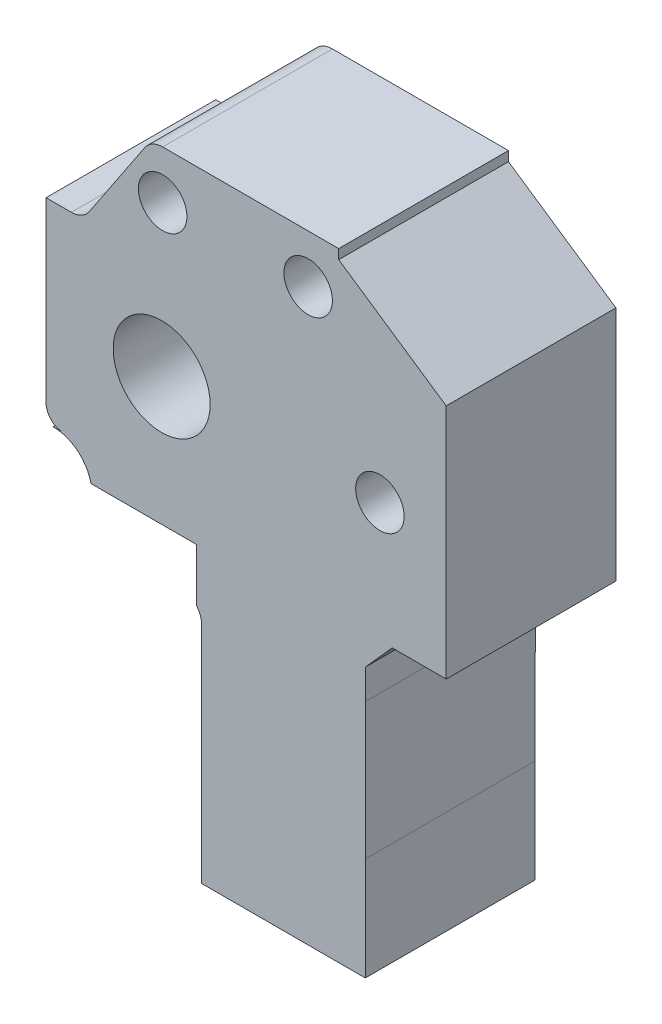
ISO-10303-21;
HEADER;
FILE_DESCRIPTION(('STEP AP214'),'2;1');
FILE_NAME('part.step','',(''),(''),'','','');
FILE_SCHEMA(('AUTOMOTIVE_DESIGN { 1 0 10303 214 1 1 1 1 }'));
ENDSEC;
DATA;
#1=APPLICATION_CONTEXT('core data for automotive mechanical design processes');
#2=APPLICATION_PROTOCOL_DEFINITION('international standard','automotive_design',2000,#1);
#3=PRODUCT_CONTEXT('',#1,'mechanical');
#4=PRODUCT('Part','Part','',(#3));
#5=PRODUCT_RELATED_PRODUCT_CATEGORY('part','',(#4));
#6=PRODUCT_DEFINITION_FORMATION('','',#4);
#7=PRODUCT_DEFINITION_CONTEXT('part definition',#1,'design');
#8=PRODUCT_DEFINITION('design','',#6,#7);
#9=PRODUCT_DEFINITION_SHAPE('','',#8);
#10=(LENGTH_UNIT() NAMED_UNIT(*) SI_UNIT(.MILLI.,.METRE.));
#11=(NAMED_UNIT(*) PLANE_ANGLE_UNIT() SI_UNIT($,.RADIAN.));
#12=(NAMED_UNIT(*) SI_UNIT($,.STERADIAN.) SOLID_ANGLE_UNIT());
#13=UNCERTAINTY_MEASURE_WITH_UNIT(LENGTH_MEASURE(1.E-05),#10,'distance_accuracy_value','');
#14=(GEOMETRIC_REPRESENTATION_CONTEXT(3) GLOBAL_UNCERTAINTY_ASSIGNED_CONTEXT((#13)) GLOBAL_UNIT_ASSIGNED_CONTEXT((#10,
#11,#12)) REPRESENTATION_CONTEXT('',''));
#15=CARTESIAN_POINT('',(0.,0.,0.));
#16=DIRECTION('',(0.,0.,1.));
#17=DIRECTION('',(1.,0.,0.));
#18=AXIS2_PLACEMENT_3D('',#15,#16,#17);
#19=CARTESIAN_POINT('',(-6.13187275339475,28.106753136877,7.));
#20=DIRECTION('',(0.,0.,1.));
#21=DIRECTION('',(1.,0.,0.));
#22=AXIS2_PLACEMENT_3D('',#19,#20,#21);
#23=PLANE('',#22);
#24=CARTESIAN_POINT('',(-6.13187275339475,25.9063322097842,7.));
#25=DIRECTION('',(0.,0.,1.));
#26=DIRECTION('',(1.,0.,0.));
#27=AXIS2_PLACEMENT_3D('',#24,#25,#26);
#28=CIRCLE('',#27,2.);
#29=CARTESIAN_POINT('',(-4.13187275339475,25.9063322097842,7.));
#30=VERTEX_POINT('',#29);
#31=EDGE_CURVE('E464',#30,#30,#28,.T.);
#32=ORIENTED_EDGE('',*,*,#31,.F.);
#33=EDGE_LOOP('',(#32));
#34=FACE_BOUND('',#33,.T.);
#35=CARTESIAN_POINT('',(-6.21378457701399,13.4458067170283,7.));
#36=DIRECTION('',(0.,0.,1.));
#37=DIRECTION('',(1.,0.,0.));
#38=AXIS2_PLACEMENT_3D('',#35,#36,#37);
#39=CIRCLE('',#38,4.);
#40=CARTESIAN_POINT('',(-2.21378457701399,13.4458067170283,7.));
#41=VERTEX_POINT('',#40);
#42=EDGE_CURVE('E231',#41,#41,#39,.T.);
#43=ORIENTED_EDGE('',*,*,#42,.F.);
#44=EDGE_LOOP('',(#43));
#45=FACE_BOUND('',#44,.T.);
#46=CARTESIAN_POINT('',(-6.13187275339475,28.106753136877,7.));
#47=DIRECTION('',(0.,0.,1.));
#48=DIRECTION('',(1.,0.,0.));
#49=AXIS2_PLACEMENT_3D('',#46,#47,#48);
#50=CIRCLE('',#49,1.78004162319104);
#51=CARTESIAN_POINT('',(-6.13187275339475,29.8867947600681,7.));
#52=VERTEX_POINT('',#51);
#53=CARTESIAN_POINT('',(-7.61291394691271,29.0942070160002,7.));
#54=VERTEX_POINT('',#53);
#55=EDGE_CURVE('E295',#52,#54,#50,.T.);
#56=ORIENTED_EDGE('',*,*,#55,.T.);
#57=DIRECTION('',(-0.554736398440518,-0.832026158390013,0.));
#58=VECTOR('',#57,1.);
#59=CARTESIAN_POINT('',(-7.61291394691271,29.0942070160002,7.));
#60=LINE('',#59,#58);
#61=CARTESIAN_POINT('',(-12.1784259925533,22.2465845071899,7.));
#62=VERTEX_POINT('',#61);
#63=EDGE_CURVE('E140',#54,#62,#60,.T.);
#64=ORIENTED_EDGE('',*,*,#63,.T.);
#65=CARTESIAN_POINT('',(-13.6594743751064,23.234043179455,7.));
#66=DIRECTION('',(0.,0.,-1.));
#67=DIRECTION('',(-1.,0.,0.));
#68=AXIS2_PLACEMENT_3D('',#65,#66,#67);
#69=CIRCLE('',#68,1.7800502635866);
#70=CARTESIAN_POINT('',(-13.6594743751064,21.4539929158684,7.));
#71=VERTEX_POINT('',#70);
#72=EDGE_CURVE('E372',#62,#71,#69,.T.);
#73=ORIENTED_EDGE('',*,*,#72,.T.);
#74=DIRECTION('',(-1.,0.,0.));
#75=VECTOR('',#74,1.);
#76=CARTESIAN_POINT('',(-13.6594743751064,21.4539929158684,7.));
#77=LINE('',#76,#75);
#78=CARTESIAN_POINT('',(-15.7481092740394,21.4539929158684,7.));
#79=VERTEX_POINT('',#78);
#80=EDGE_CURVE('E389',#71,#79,#77,.T.);
#81=ORIENTED_EDGE('',*,*,#80,.T.);
#82=DIRECTION('',(0.,-1.,0.));
#83=VECTOR('',#82,1.);
#84=CARTESIAN_POINT('',(-15.7481092740394,20.0891093991927,7.));
#85=LINE('',#84,#83);
#86=CARTESIAN_POINT('',(-15.7481092740394,6.80250403486396,7.));
#87=VERTEX_POINT('',#86);
#88=EDGE_CURVE('E385',#79,#87,#85,.T.);
#89=ORIENTED_EDGE('',*,*,#88,.T.);
#90=CARTESIAN_POINT('',(-14.3323999992435,6.80250403486396,7.));
#91=DIRECTION('',(0.,0.,1.));
#92=DIRECTION('',(1.,0.,0.));
#93=AXIS2_PLACEMENT_3D('',#90,#91,#92);
#94=CIRCLE('',#93,1.4157092747959);
#95=CARTESIAN_POINT('',(-14.3323999992435,5.38679476006807,7.));
#96=VERTEX_POINT('',#95);
#97=EDGE_CURVE('E388',#87,#96,#94,.T.);
#98=ORIENTED_EDGE('',*,*,#97,.T.);
#99=DIRECTION('',(-1.,0.,0.));
#100=VECTOR('',#99,1.);
#101=CARTESIAN_POINT('',(-14.3323999992435,5.38679476006807,7.));
#102=LINE('',#101,#100);
#103=CARTESIAN_POINT('',(-15.16073289837,5.38679476006807,7.));
#104=VERTEX_POINT('',#103);
#105=EDGE_CURVE('E393',#96,#104,#102,.T.);
#106=ORIENTED_EDGE('',*,*,#105,.T.);
#107=CARTESIAN_POINT('',(-15.16073289837,2.1890566843532,7.));
#108=DIRECTION('',(0.,0.,-1.));
#109=DIRECTION('',(-1.,0.,0.));
#110=AXIS2_PLACEMENT_3D('',#107,#108,#109);
#111=CIRCLE('',#110,3.19773807571487);
#112=CARTESIAN_POINT('',(-12.040045413444,2.88679476006807,7.));
#113=VERTEX_POINT('',#112);
#114=EDGE_CURVE('E400',#104,#113,#111,.T.);
#115=ORIENTED_EDGE('',*,*,#114,.T.);
#116=DIRECTION('',(1.,0.,0.));
#117=VECTOR('',#116,1.);
#118=CARTESIAN_POINT('',(-3.35979770452583,2.88679476006807,7.));
#119=LINE('',#118,#117);
#120=CARTESIAN_POINT('',(-3.35979770452583,2.88679476006807,7.));
#121=VERTEX_POINT('',#120);
#122=EDGE_CURVE('E403',#113,#121,#119,.T.);
#123=ORIENTED_EDGE('',*,*,#122,.T.);
#124=DIRECTION('',(0.,-1.,0.));
#125=VECTOR('',#124,1.);
#126=CARTESIAN_POINT('',(-3.35979770452583,-1.46175483702171,7.));
#127=LINE('',#126,#125);
#128=CARTESIAN_POINT('',(-3.35979770452583,-1.46175483702171,7.));
#129=VERTEX_POINT('',#128);
#130=EDGE_CURVE('E406',#121,#129,#127,.T.);
#131=ORIENTED_EDGE('',*,*,#130,.T.);
#132=CARTESIAN_POINT('',(-4.63204737409248,-2.61320523993193,7.));
#133=DIRECTION('',(0.,0.,-1.));
#134=DIRECTION('',(1.,0.,0.));
#135=AXIS2_PLACEMENT_3D('',#132,#133,#134);
#136=CIRCLE('',#135,1.71594208878813);
#137=CARTESIAN_POINT('',(-2.91610528530435,-2.61320523993193,7.));
#138=VERTEX_POINT('',#137);
#139=EDGE_CURVE('E409',#129,#138,#136,.T.);
#140=ORIENTED_EDGE('',*,*,#139,.T.);
#141=DIRECTION('',(0.,-1.,0.));
#142=VECTOR('',#141,1.);
#143=CARTESIAN_POINT('',(-2.91610528530435,-12.6132052399319,7.));
#144=LINE('',#143,#142);
#145=CARTESIAN_POINT('',(-2.91610528530436,-21.1132052399319,7.));
#146=VERTEX_POINT('',#145);
#147=EDGE_CURVE('E412',#138,#146,#144,.T.);
#148=ORIENTED_EDGE('',*,*,#147,.T.);
#149=DIRECTION('',(1.,0.,0.));
#150=VECTOR('',#149,1.);
#151=CARTESIAN_POINT('',(10.5817296236431,-21.1132052399319,7.));
#152=LINE('',#151,#150);
#153=CARTESIAN_POINT('',(10.5817296236431,-21.1132052399319,7.));
#154=VERTEX_POINT('',#153);
#155=EDGE_CURVE('E415',#146,#154,#152,.T.);
#156=ORIENTED_EDGE('',*,*,#155,.T.);
#157=DIRECTION('',(0.,1.,0.));
#158=VECTOR('',#157,1.);
#159=CARTESIAN_POINT('',(10.5817296236431,-12.6132052399319,7.));
#160=LINE('',#159,#158);
#161=CARTESIAN_POINT('',(10.5817296236431,-12.6132052399319,7.));
#162=VERTEX_POINT('',#161);
#163=EDGE_CURVE('E418',#154,#162,#160,.T.);
#164=ORIENTED_EDGE('',*,*,#163,.T.);
#165=DIRECTION('',(0.00194331380217863,0.99999811176395,0.));
#166=VECTOR('',#165,1.);
#167=CARTESIAN_POINT('',(10.6036252691299,-1.3460572795676,7.));
#168=LINE('',#167,#166);
#169=CARTESIAN_POINT('',(10.6036252691299,-1.3460572795676,7.));
#170=VERTEX_POINT('',#169);
#171=EDGE_CURVE('E421',#162,#170,#168,.T.);
#172=ORIENTED_EDGE('',*,*,#171,.T.);
#173=DIRECTION('',(0.,1.,0.));
#174=VECTOR('',#173,1.);
#175=CARTESIAN_POINT('',(10.6036252691299,1.11753321982605,7.));
#176=LINE('',#175,#174);
#177=CARTESIAN_POINT('',(10.6036252691299,1.11753321982605,7.));
#178=VERTEX_POINT('',#177);
#179=EDGE_CURVE('E424',#170,#178,#176,.T.);
#180=ORIENTED_EDGE('',*,*,#179,.T.);
#181=DIRECTION('',(0.666553541988989,0.745457158837403,0.));
#182=VECTOR('',#181,1.);
#183=CARTESIAN_POINT('',(12.7984079936805,3.57212447325602,7.));
#184=LINE('',#183,#182);
#185=CARTESIAN_POINT('',(12.7984079936805,3.57212447325602,7.));
#186=VERTEX_POINT('',#185);
#187=EDGE_CURVE('E427',#178,#186,#184,.T.);
#188=ORIENTED_EDGE('',*,*,#187,.T.);
#189=DIRECTION('',(1.,0.,0.));
#190=VECTOR('',#189,1.);
#191=CARTESIAN_POINT('',(12.7984079936805,3.57212447325602,7.));
#192=LINE('',#191,#190);
#193=CARTESIAN_POINT('',(17.2518907259606,3.57212447325602,7.));
#194=VERTEX_POINT('',#193);
#195=EDGE_CURVE('E430',#186,#194,#192,.T.);
#196=ORIENTED_EDGE('',*,*,#195,.T.);
#197=DIRECTION('',(0.,1.,0.));
#198=VECTOR('',#197,1.);
#199=CARTESIAN_POINT('',(17.2518907259606,3.57212447325602,7.));
#200=LINE('',#199,#198);
#201=CARTESIAN_POINT('',(17.2518907259606,23.0863460102458,7.));
#202=VERTEX_POINT('',#201);
#203=EDGE_CURVE('E202',#194,#202,#200,.T.);
#204=ORIENTED_EDGE('',*,*,#203,.T.);
#205=DIRECTION('',(-0.827802869013359,0.561019081719376,0.));
#206=VECTOR('',#205,1.);
#207=CARTESIAN_POINT('',(8.38708605308729,29.0942070160002,7.));
#208=LINE('',#207,#206);
#209=CARTESIAN_POINT('',(8.38708605308729,29.0942070160002,7.));
#210=VERTEX_POINT('',#209);
#211=EDGE_CURVE('E195',#202,#210,#208,.T.);
#212=ORIENTED_EDGE('',*,*,#211,.T.);
#213=DIRECTION('',(0.,1.,0.));
#214=VECTOR('',#213,1.);
#215=CARTESIAN_POINT('',(8.38708605308729,29.8867947600681,7.));
#216=LINE('',#215,#214);
#217=CARTESIAN_POINT('',(8.38708605308729,29.8867947600681,7.));
#218=VERTEX_POINT('',#217);
#219=EDGE_CURVE('E199',#210,#218,#216,.T.);
#220=ORIENTED_EDGE('',*,*,#219,.T.);
#221=DIRECTION('',(-1.,0.,0.));
#222=VECTOR('',#221,1.);
#223=CARTESIAN_POINT('',(7.59449830901946,29.8867947600681,7.));
#224=LINE('',#223,#222);
#225=EDGE_CURVE('E57',#218,#52,#224,.T.);
#226=ORIENTED_EDGE('',*,*,#225,.T.);
#227=EDGE_LOOP('',(#56,#64,#73,#81,#89,#98,#106,#115,#123,#131,#140,#148,#156,#164,#172,#180,
#188,#196,#204,#212,#220,#226));
#228=FACE_BOUND('',#227,.T.);
#229=CARTESIAN_POINT('',(11.786215422986,13.4458067170283,7.));
#230=DIRECTION('',(0.,0.,1.));
#231=DIRECTION('',(1.,0.,0.));
#232=AXIS2_PLACEMENT_3D('',#229,#230,#231);
#233=CIRCLE('',#232,2.);
#234=CARTESIAN_POINT('',(13.786215422986,13.4458067170283,7.));
#235=VERTEX_POINT('',#234);
#236=EDGE_CURVE('E456',#235,#235,#233,.T.);
#237=ORIENTED_EDGE('',*,*,#236,.F.);
#238=EDGE_LOOP('',(#237));
#239=FACE_BOUND('',#238,.T.);
#240=CARTESIAN_POINT('',(5.86812724660525,25.9063322097842,7.));
#241=DIRECTION('',(0.,0.,1.));
#242=DIRECTION('',(1.,0.,0.));
#243=AXIS2_PLACEMENT_3D('',#240,#241,#242);
#244=CIRCLE('',#243,2.);
#245=CARTESIAN_POINT('',(7.86812724660525,25.9063322097842,7.));
#246=VERTEX_POINT('',#245);
#247=EDGE_CURVE('E472',#246,#246,#244,.T.);
#248=ORIENTED_EDGE('',*,*,#247,.F.);
#249=EDGE_LOOP('',(#248));
#250=FACE_BOUND('',#249,.T.);
#251=ADVANCED_FACE('F39',(#34,#45,#228,#239,#250),#23,.T.);
#252=CARTESIAN_POINT('',(-6.13187275339475,28.106753136877,-7.));
#253=DIRECTION('',(0.,0.,1.));
#254=DIRECTION('',(1.,0.,0.));
#255=AXIS2_PLACEMENT_3D('',#252,#253,#254);
#256=PLANE('',#255);
#257=CARTESIAN_POINT('',(-6.13187275339475,28.106753136877,-7.));
#258=DIRECTION('',(0.,0.,1.));
#259=DIRECTION('',(1.,0.,0.));
#260=AXIS2_PLACEMENT_3D('',#257,#258,#259);
#261=CIRCLE('',#260,1.78004162319104);
#262=CARTESIAN_POINT('',(-6.13187275339475,29.8867947600681,-7.));
#263=VERTEX_POINT('',#262);
#264=CARTESIAN_POINT('',(-7.61291394691271,29.0942070160002,-7.));
#265=VERTEX_POINT('',#264);
#266=EDGE_CURVE('E226',#263,#265,#261,.T.);
#267=ORIENTED_EDGE('',*,*,#266,.F.);
#268=DIRECTION('',(-1.,0.,0.));
#269=VECTOR('',#268,1.);
#270=CARTESIAN_POINT('',(-6.13187275339475,29.8867947600681,-7.));
#271=LINE('',#270,#269);
#272=CARTESIAN_POINT('',(8.38708605308729,29.8867947600681,-7.));
#273=VERTEX_POINT('',#272);
#274=EDGE_CURVE('E128',#273,#263,#271,.T.);
#275=ORIENTED_EDGE('',*,*,#274,.F.);
#276=DIRECTION('',(0.,1.,0.));
#277=VECTOR('',#276,1.);
#278=CARTESIAN_POINT('',(8.38708605308729,29.8867947600681,-7.));
#279=LINE('',#278,#277);
#280=CARTESIAN_POINT('',(8.38708605308729,29.0942070160002,-7.));
#281=VERTEX_POINT('',#280);
#282=EDGE_CURVE('E290',#281,#273,#279,.T.);
#283=ORIENTED_EDGE('',*,*,#282,.F.);
#284=DIRECTION('',(-0.827802869013359,0.561019081719376,0.));
#285=VECTOR('',#284,1.);
#286=CARTESIAN_POINT('',(8.38708605308729,29.0942070160002,-7.));
#287=LINE('',#286,#285);
#288=CARTESIAN_POINT('',(17.2518907259606,23.0863460102458,-7.));
#289=VERTEX_POINT('',#288);
#290=EDGE_CURVE('E212',#289,#281,#287,.T.);
#291=ORIENTED_EDGE('',*,*,#290,.F.);
#292=DIRECTION('',(0.,1.,0.));
#293=VECTOR('',#292,1.);
#294=CARTESIAN_POINT('',(17.2518907259606,23.0863460102458,-7.));
#295=LINE('',#294,#293);
#296=CARTESIAN_POINT('',(17.2518907259606,3.57212447325602,-7.));
#297=VERTEX_POINT('',#296);
#298=EDGE_CURVE('E285',#297,#289,#295,.T.);
#299=ORIENTED_EDGE('',*,*,#298,.F.);
#300=DIRECTION('',(1.,0.,0.));
#301=VECTOR('',#300,1.);
#302=CARTESIAN_POINT('',(12.7984079936805,3.57212447325602,-7.));
#303=LINE('',#302,#301);
#304=CARTESIAN_POINT('',(12.7984079936805,3.57212447325602,-7.));
#305=VERTEX_POINT('',#304);
#306=EDGE_CURVE('E281',#305,#297,#303,.T.);
#307=ORIENTED_EDGE('',*,*,#306,.F.);
#308=DIRECTION('',(0.666553541988989,0.745457158837403,0.));
#309=VECTOR('',#308,1.);
#310=CARTESIAN_POINT('',(12.7984079936805,3.57212447325602,-7.));
#311=LINE('',#310,#309);
#312=CARTESIAN_POINT('',(10.6036252691299,1.11753321982605,-7.));
#313=VERTEX_POINT('',#312);
#314=EDGE_CURVE('E278',#313,#305,#311,.T.);
#315=ORIENTED_EDGE('',*,*,#314,.F.);
#316=DIRECTION('',(0.,1.,0.));
#317=VECTOR('',#316,1.);
#318=CARTESIAN_POINT('',(10.6036252691299,1.11753321982605,-7.));
#319=LINE('',#318,#317);
#320=CARTESIAN_POINT('',(10.6036252691299,-1.3460572795676,-7.));
#321=VERTEX_POINT('',#320);
#322=EDGE_CURVE('E275',#321,#313,#319,.T.);
#323=ORIENTED_EDGE('',*,*,#322,.F.);
#324=DIRECTION('',(0.00194331380217863,0.99999811176395,0.));
#325=VECTOR('',#324,1.);
#326=CARTESIAN_POINT('',(10.6036252691299,-1.3460572795676,-7.));
#327=LINE('',#326,#325);
#328=CARTESIAN_POINT('',(10.5817296236431,-12.6132052399319,-7.));
#329=VERTEX_POINT('',#328);
#330=EDGE_CURVE('E272',#329,#321,#327,.T.);
#331=ORIENTED_EDGE('',*,*,#330,.F.);
#332=DIRECTION('',(0.,1.,0.));
#333=VECTOR('',#332,1.);
#334=CARTESIAN_POINT('',(10.5817296236431,-12.6132052399319,-7.));
#335=LINE('',#334,#333);
#336=CARTESIAN_POINT('',(10.5817296236431,-21.1132052399319,-7.));
#337=VERTEX_POINT('',#336);
#338=EDGE_CURVE('E269',#337,#329,#335,.T.);
#339=ORIENTED_EDGE('',*,*,#338,.F.);
#340=DIRECTION('',(1.,0.,0.));
#341=VECTOR('',#340,1.);
#342=CARTESIAN_POINT('',(10.5817296236431,-21.1132052399319,-7.));
#343=LINE('',#342,#341);
#344=CARTESIAN_POINT('',(-2.91610528530436,-21.1132052399319,-7.));
#345=VERTEX_POINT('',#344);
#346=EDGE_CURVE('E266',#345,#337,#343,.T.);
#347=ORIENTED_EDGE('',*,*,#346,.F.);
#348=DIRECTION('',(0.,-1.,0.));
#349=VECTOR('',#348,1.);
#350=CARTESIAN_POINT('',(-2.91610528530436,-21.1132052399319,-7.));
#351=LINE('',#350,#349);
#352=CARTESIAN_POINT('',(-2.91610528530435,-2.61320523993193,-7.));
#353=VERTEX_POINT('',#352);
#354=EDGE_CURVE('E263',#353,#345,#351,.T.);
#355=ORIENTED_EDGE('',*,*,#354,.F.);
#356=CARTESIAN_POINT('',(-4.63204737409248,-2.61320523993193,-7.));
#357=DIRECTION('',(0.,0.,-1.));
#358=DIRECTION('',(1.,0.,0.));
#359=AXIS2_PLACEMENT_3D('',#356,#357,#358);
#360=CIRCLE('',#359,1.71594208878813);
#361=CARTESIAN_POINT('',(-3.35979770452583,-1.46175483702171,-7.));
#362=VERTEX_POINT('',#361);
#363=EDGE_CURVE('E259',#362,#353,#360,.T.);
#364=ORIENTED_EDGE('',*,*,#363,.F.);
#365=DIRECTION('',(0.,-1.,0.));
#366=VECTOR('',#365,1.);
#367=CARTESIAN_POINT('',(-3.35979770452583,-1.46175483702171,-7.));
#368=LINE('',#367,#366);
#369=CARTESIAN_POINT('',(-3.35979770452583,2.88679476006807,-7.));
#370=VERTEX_POINT('',#369);
#371=EDGE_CURVE('E256',#370,#362,#368,.T.);
#372=ORIENTED_EDGE('',*,*,#371,.F.);
#373=DIRECTION('',(1.,0.,0.));
#374=VECTOR('',#373,1.);
#375=CARTESIAN_POINT('',(-3.35979770452583,2.88679476006807,-7.));
#376=LINE('',#375,#374);
#377=CARTESIAN_POINT('',(-12.040045413444,2.88679476006807,-7.));
#378=VERTEX_POINT('',#377);
#379=EDGE_CURVE('E253',#378,#370,#376,.T.);
#380=ORIENTED_EDGE('',*,*,#379,.F.);
#381=CARTESIAN_POINT('',(-15.16073289837,2.1890566843532,-7.));
#382=DIRECTION('',(0.,0.,-1.));
#383=DIRECTION('',(-1.,0.,0.));
#384=AXIS2_PLACEMENT_3D('',#381,#382,#383);
#385=CIRCLE('',#384,3.19773807571487);
#386=CARTESIAN_POINT('',(-15.16073289837,5.38679476006807,-7.));
#387=VERTEX_POINT('',#386);
#388=EDGE_CURVE('E250',#387,#378,#385,.T.);
#389=ORIENTED_EDGE('',*,*,#388,.F.);
#390=DIRECTION('',(-1.,0.,0.));
#391=VECTOR('',#390,1.);
#392=CARTESIAN_POINT('',(-14.3323999992435,5.38679476006807,-7.));
#393=LINE('',#392,#391);
#394=CARTESIAN_POINT('',(-14.3323999992435,5.38679476006807,-7.));
#395=VERTEX_POINT('',#394);
#396=EDGE_CURVE('E247',#395,#387,#393,.T.);
#397=ORIENTED_EDGE('',*,*,#396,.F.);
#398=CARTESIAN_POINT('',(-14.3323999992435,6.80250403486396,-7.));
#399=DIRECTION('',(0.,0.,1.));
#400=DIRECTION('',(1.,0.,0.));
#401=AXIS2_PLACEMENT_3D('',#398,#399,#400);
#402=CIRCLE('',#401,1.4157092747959);
#403=CARTESIAN_POINT('',(-15.7481092740394,6.80250403486396,-7.));
#404=VERTEX_POINT('',#403);
#405=EDGE_CURVE('E244',#404,#395,#402,.T.);
#406=ORIENTED_EDGE('',*,*,#405,.F.);
#407=DIRECTION('',(0.,-1.,0.));
#408=VECTOR('',#407,1.);
#409=CARTESIAN_POINT('',(-15.7481092740394,20.0891093991927,-7.));
#410=LINE('',#409,#408);
#411=CARTESIAN_POINT('',(-15.7481092740394,21.4539929158684,-7.));
#412=VERTEX_POINT('',#411);
#413=EDGE_CURVE('E241',#412,#404,#410,.T.);
#414=ORIENTED_EDGE('',*,*,#413,.F.);
#415=DIRECTION('',(-1.,0.,0.));
#416=VECTOR('',#415,1.);
#417=CARTESIAN_POINT('',(-13.6594743751064,21.4539929158684,-7.));
#418=LINE('',#417,#416);
#419=CARTESIAN_POINT('',(-13.6594743751064,21.4539929158684,-7.));
#420=VERTEX_POINT('',#419);
#421=EDGE_CURVE('E237',#420,#412,#418,.T.);
#422=ORIENTED_EDGE('',*,*,#421,.F.);
#423=CARTESIAN_POINT('',(-13.6594743751064,23.234043179455,-7.));
#424=DIRECTION('',(0.,0.,-1.));
#425=DIRECTION('',(-1.,0.,0.));
#426=AXIS2_PLACEMENT_3D('',#423,#424,#425);
#427=CIRCLE('',#426,1.7800502635866);
#428=CARTESIAN_POINT('',(-12.1784259925533,22.2465845071899,-7.));
#429=VERTEX_POINT('',#428);
#430=EDGE_CURVE('E234',#429,#420,#427,.T.);
#431=ORIENTED_EDGE('',*,*,#430,.F.);
#432=DIRECTION('',(-0.554736398440518,-0.832026158390013,0.));
#433=VECTOR('',#432,1.);
#434=CARTESIAN_POINT('',(-7.61291394691271,29.0942070160002,-7.));
#435=LINE('',#434,#433);
#436=EDGE_CURVE('E230',#265,#429,#435,.T.);
#437=ORIENTED_EDGE('',*,*,#436,.F.);
#438=EDGE_LOOP('',(#267,#275,#283,#291,#299,#307,#315,#323,#331,#339,#347,#355,#364,#372,#380,
#389,#397,#406,#414,#422,#431,#437));
#439=FACE_BOUND('',#438,.T.);
#440=CARTESIAN_POINT('',(-6.21378457701399,13.4458067170283,-7.));
#441=DIRECTION('',(0.,0.,1.));
#442=DIRECTION('',(1.,0.,0.));
#443=AXIS2_PLACEMENT_3D('',#440,#441,#442);
#444=CIRCLE('',#443,4.);
#445=CARTESIAN_POINT('',(-2.21378457701399,13.4458067170283,-7.));
#446=VERTEX_POINT('',#445);
#447=EDGE_CURVE('E451',#446,#446,#444,.T.);
#448=ORIENTED_EDGE('',*,*,#447,.T.);
#449=EDGE_LOOP('',(#448));
#450=FACE_BOUND('',#449,.T.);
#451=CARTESIAN_POINT('',(11.786215422986,13.4458067170283,-7.));
#452=DIRECTION('',(0.,0.,1.));
#453=DIRECTION('',(1.,0.,0.));
#454=AXIS2_PLACEMENT_3D('',#451,#452,#453);
#455=CIRCLE('',#454,2.);
#456=CARTESIAN_POINT('',(13.786215422986,13.4458067170283,-7.));
#457=VERTEX_POINT('',#456);
#458=EDGE_CURVE('E460',#457,#457,#455,.T.);
#459=ORIENTED_EDGE('',*,*,#458,.T.);
#460=EDGE_LOOP('',(#459));
#461=FACE_BOUND('',#460,.T.);
#462=CARTESIAN_POINT('',(-6.13187275339475,25.9063322097842,-7.));
#463=DIRECTION('',(0.,0.,1.));
#464=DIRECTION('',(1.,0.,0.));
#465=AXIS2_PLACEMENT_3D('',#462,#463,#464);
#466=CIRCLE('',#465,2.);
#467=CARTESIAN_POINT('',(-4.13187275339475,25.9063322097842,-7.));
#468=VERTEX_POINT('',#467);
#469=EDGE_CURVE('E468',#468,#468,#466,.T.);
#470=ORIENTED_EDGE('',*,*,#469,.T.);
#471=EDGE_LOOP('',(#470));
#472=FACE_BOUND('',#471,.T.);
#473=CARTESIAN_POINT('',(5.86812724660525,25.9063322097842,-7.));
#474=DIRECTION('',(0.,0.,1.));
#475=DIRECTION('',(1.,0.,0.));
#476=AXIS2_PLACEMENT_3D('',#473,#474,#475);
#477=CIRCLE('',#476,2.);
#478=CARTESIAN_POINT('',(7.86812724660525,25.9063322097842,-7.));
#479=VERTEX_POINT('',#478);
#480=EDGE_CURVE('E476',#479,#479,#477,.T.);
#481=ORIENTED_EDGE('',*,*,#480,.T.);
#482=EDGE_LOOP('',(#481));
#483=FACE_BOUND('',#482,.T.);
#484=ADVANCED_FACE('F374',(#439,#450,#461,#472,#483),#256,.F.);
#485=CARTESIAN_POINT('',(-6.13187275339475,28.106753136877,7.));
#486=DIRECTION('',(0.,0.,-1.));
#487=DIRECTION('',(-1.,0.,0.));
#488=AXIS2_PLACEMENT_3D('',#485,#486,#487);
#489=CYLINDRICAL_SURFACE('',#488,1.78004162319104);
#490=ORIENTED_EDGE('',*,*,#266,.T.);
#491=DIRECTION('',(0.,0.,-1.));
#492=VECTOR('',#491,1.);
#493=CARTESIAN_POINT('',(-7.61291394691271,29.0942070160002,7.));
#494=LINE('',#493,#492);
#495=EDGE_CURVE('E11',#54,#265,#494,.T.);
#496=ORIENTED_EDGE('',*,*,#495,.F.);
#497=ORIENTED_EDGE('',*,*,#55,.F.);
#498=DIRECTION('',(0.,0.,-1.));
#499=VECTOR('',#498,1.);
#500=CARTESIAN_POINT('',(-6.13187275339475,29.8867947600681,7.));
#501=LINE('',#500,#499);
#502=EDGE_CURVE('E222',#52,#263,#501,.T.);
#503=ORIENTED_EDGE('',*,*,#502,.T.);
#504=EDGE_LOOP('',(#490,#496,#497,#503));
#505=FACE_BOUND('',#504,.T.);
#506=ADVANCED_FACE('F41',(#505),#489,.T.);
#507=CARTESIAN_POINT('',(-7.61291394691271,29.0942070160002,7.));
#508=DIRECTION('',(0.832026158390013,-0.554736398440518,0.));
#509=DIRECTION('',(0.554736398440518,0.832026158390013,0.));
#510=AXIS2_PLACEMENT_3D('',#507,#508,#509);
#511=PLANE('',#510);
#512=ORIENTED_EDGE('',*,*,#436,.T.);
#513=DIRECTION('',(0.,0.,-1.));
#514=VECTOR('',#513,1.);
#515=CARTESIAN_POINT('',(-12.1784259925533,22.2465845071899,7.));
#516=LINE('',#515,#514);
#517=EDGE_CURVE('E49',#62,#429,#516,.T.);
#518=ORIENTED_EDGE('',*,*,#517,.F.);
#519=ORIENTED_EDGE('',*,*,#63,.F.);
#520=ORIENTED_EDGE('',*,*,#495,.T.);
#521=EDGE_LOOP('',(#512,#518,#519,#520));
#522=FACE_BOUND('',#521,.T.);
#523=ADVANCED_FACE('F563',(#522),#511,.F.);
#524=CARTESIAN_POINT('',(-13.6594743751064,23.234043179455,7.));
#525=DIRECTION('',(0.,0.,-1.));
#526=DIRECTION('',(-1.,0.,0.));
#527=AXIS2_PLACEMENT_3D('',#524,#525,#526);
#528=CYLINDRICAL_SURFACE('',#527,1.7800502635866);
#529=ORIENTED_EDGE('',*,*,#430,.T.);
#530=DIRECTION('',(0.,0.,-1.));
#531=VECTOR('',#530,1.);
#532=CARTESIAN_POINT('',(-13.6594743751064,21.4539929158684,7.));
#533=LINE('',#532,#531);
#534=EDGE_CURVE('E362',#71,#420,#533,.T.);
#535=ORIENTED_EDGE('',*,*,#534,.F.);
#536=ORIENTED_EDGE('',*,*,#72,.F.);
#537=ORIENTED_EDGE('',*,*,#517,.T.);
#538=EDGE_LOOP('',(#529,#535,#536,#537));
#539=FACE_BOUND('',#538,.T.);
#540=ADVANCED_FACE('F370',(#539),#528,.F.);
#541=CARTESIAN_POINT('',(-13.6594743751064,21.4539929158684,7.));
#542=DIRECTION('',(0.,-1.,0.));
#543=DIRECTION('',(0.,0.,-1.));
#544=AXIS2_PLACEMENT_3D('',#541,#542,#543);
#545=PLANE('',#544);
#546=ORIENTED_EDGE('',*,*,#421,.T.);
#547=DIRECTION('',(0.,0.,-1.));
#548=VECTOR('',#547,1.);
#549=CARTESIAN_POINT('',(-15.7481092740394,21.4539929158684,7.));
#550=LINE('',#549,#548);
#551=EDGE_CURVE('E358',#79,#412,#550,.T.);
#552=ORIENTED_EDGE('',*,*,#551,.F.);
#553=ORIENTED_EDGE('',*,*,#80,.F.);
#554=ORIENTED_EDGE('',*,*,#534,.T.);
#555=EDGE_LOOP('',(#546,#552,#553,#554));
#556=FACE_BOUND('',#555,.T.);
#557=ADVANCED_FACE('F379',(#556),#545,.F.);
#558=CARTESIAN_POINT('',(-15.7481092740394,20.0891093991927,7.));
#559=DIRECTION('',(1.,0.,0.));
#560=DIRECTION('',(0.,0.,-1.));
#561=AXIS2_PLACEMENT_3D('',#558,#559,#560);
#562=PLANE('',#561);
#563=ORIENTED_EDGE('',*,*,#413,.T.);
#564=DIRECTION('',(0.,0.,-1.));
#565=VECTOR('',#564,1.);
#566=CARTESIAN_POINT('',(-15.7481092740394,6.80250403486396,7.));
#567=LINE('',#566,#565);
#568=EDGE_CURVE('E354',#87,#404,#567,.T.);
#569=ORIENTED_EDGE('',*,*,#568,.F.);
#570=ORIENTED_EDGE('',*,*,#88,.F.);
#571=ORIENTED_EDGE('',*,*,#551,.T.);
#572=EDGE_LOOP('',(#563,#569,#570,#571));
#573=FACE_BOUND('',#572,.T.);
#574=ADVANCED_FACE('F383',(#573),#562,.F.);
#575=CARTESIAN_POINT('',(-14.3323999992435,6.80250403486396,7.));
#576=DIRECTION('',(0.,0.,-1.));
#577=DIRECTION('',(-1.,0.,0.));
#578=AXIS2_PLACEMENT_3D('',#575,#576,#577);
#579=CYLINDRICAL_SURFACE('',#578,1.4157092747959);
#580=ORIENTED_EDGE('',*,*,#405,.T.);
#581=DIRECTION('',(0.,0.,-1.));
#582=VECTOR('',#581,1.);
#583=CARTESIAN_POINT('',(-14.3323999992435,5.38679476006807,7.));
#584=LINE('',#583,#582);
#585=EDGE_CURVE('E350',#96,#395,#584,.T.);
#586=ORIENTED_EDGE('',*,*,#585,.F.);
#587=ORIENTED_EDGE('',*,*,#97,.F.);
#588=ORIENTED_EDGE('',*,*,#568,.T.);
#589=EDGE_LOOP('',(#580,#586,#587,#588));
#590=FACE_BOUND('',#589,.T.);
#591=ADVANCED_FACE('F553',(#590),#579,.T.);
#592=CARTESIAN_POINT('',(-14.3323999992435,5.38679476006807,7.));
#593=DIRECTION('',(0.,-1.,0.));
#594=DIRECTION('',(1.,0.,0.));
#595=AXIS2_PLACEMENT_3D('',#592,#593,#594);
#596=PLANE('',#595);
#597=ORIENTED_EDGE('',*,*,#396,.T.);
#598=DIRECTION('',(0.,0.,-1.));
#599=VECTOR('',#598,1.);
#600=CARTESIAN_POINT('',(-15.16073289837,5.38679476006807,7.));
#601=LINE('',#600,#599);
#602=EDGE_CURVE('E346',#104,#387,#601,.T.);
#603=ORIENTED_EDGE('',*,*,#602,.F.);
#604=ORIENTED_EDGE('',*,*,#105,.F.);
#605=ORIENTED_EDGE('',*,*,#585,.T.);
#606=EDGE_LOOP('',(#597,#603,#604,#605));
#607=FACE_BOUND('',#606,.T.);
#608=ADVANCED_FACE('F549',(#607),#596,.F.);
#609=CARTESIAN_POINT('',(-15.16073289837,2.1890566843532,7.));
#610=DIRECTION('',(0.,0.,-1.));
#611=DIRECTION('',(-1.,0.,0.));
#612=AXIS2_PLACEMENT_3D('',#609,#610,#611);
#613=CYLINDRICAL_SURFACE('',#612,3.19773807571487);
#614=ORIENTED_EDGE('',*,*,#388,.T.);
#615=DIRECTION('',(0.,0.,-1.));
#616=VECTOR('',#615,1.);
#617=CARTESIAN_POINT('',(-12.040045413444,2.88679476006807,7.));
#618=LINE('',#617,#616);
#619=EDGE_CURVE('E342',#113,#378,#618,.T.);
#620=ORIENTED_EDGE('',*,*,#619,.F.);
#621=ORIENTED_EDGE('',*,*,#114,.F.);
#622=ORIENTED_EDGE('',*,*,#602,.T.);
#623=EDGE_LOOP('',(#614,#620,#621,#622));
#624=FACE_BOUND('',#623,.T.);
#625=ADVANCED_FACE('F545',(#624),#613,.F.);
#626=CARTESIAN_POINT('',(-3.35979770452583,2.88679476006807,7.));
#627=DIRECTION('',(0.,1.,0.));
#628=DIRECTION('',(-1.,0.,0.));
#629=AXIS2_PLACEMENT_3D('',#626,#627,#628);
#630=PLANE('',#629);
#631=ORIENTED_EDGE('',*,*,#379,.T.);
#632=DIRECTION('',(0.,0.,-1.));
#633=VECTOR('',#632,1.);
#634=CARTESIAN_POINT('',(-3.35979770452583,2.88679476006807,7.));
#635=LINE('',#634,#633);
#636=EDGE_CURVE('E338',#121,#370,#635,.T.);
#637=ORIENTED_EDGE('',*,*,#636,.F.);
#638=ORIENTED_EDGE('',*,*,#122,.F.);
#639=ORIENTED_EDGE('',*,*,#619,.T.);
#640=EDGE_LOOP('',(#631,#637,#638,#639));
#641=FACE_BOUND('',#640,.T.);
#642=ADVANCED_FACE('F541',(#641),#630,.F.);
#643=CARTESIAN_POINT('',(-3.35979770452583,-1.46175483702171,7.));
#644=DIRECTION('',(1.,0.,0.));
#645=DIRECTION('',(0.,0.,-1.));
#646=AXIS2_PLACEMENT_3D('',#643,#644,#645);
#647=PLANE('',#646);
#648=ORIENTED_EDGE('',*,*,#371,.T.);
#649=DIRECTION('',(0.,0.,-1.));
#650=VECTOR('',#649,1.);
#651=CARTESIAN_POINT('',(-3.35979770452583,-1.46175483702171,7.));
#652=LINE('',#651,#650);
#653=EDGE_CURVE('E334',#129,#362,#652,.T.);
#654=ORIENTED_EDGE('',*,*,#653,.F.);
#655=ORIENTED_EDGE('',*,*,#130,.F.);
#656=ORIENTED_EDGE('',*,*,#636,.T.);
#657=EDGE_LOOP('',(#648,#654,#655,#656));
#658=FACE_BOUND('',#657,.T.);
#659=ADVANCED_FACE('F537',(#658),#647,.F.);
#660=CARTESIAN_POINT('',(-4.63204737409248,-2.61320523993193,7.));
#661=DIRECTION('',(0.,0.,-1.));
#662=DIRECTION('',(-1.,0.,0.));
#663=AXIS2_PLACEMENT_3D('',#660,#661,#662);
#664=CYLINDRICAL_SURFACE('',#663,1.71594208878813);
#665=ORIENTED_EDGE('',*,*,#363,.T.);
#666=DIRECTION('',(0.,0.,-1.));
#667=VECTOR('',#666,1.);
#668=CARTESIAN_POINT('',(-2.91610528530435,-2.61320523993193,7.));
#669=LINE('',#668,#667);
#670=EDGE_CURVE('E330',#138,#353,#669,.T.);
#671=ORIENTED_EDGE('',*,*,#670,.F.);
#672=ORIENTED_EDGE('',*,*,#139,.F.);
#673=ORIENTED_EDGE('',*,*,#653,.T.);
#674=EDGE_LOOP('',(#665,#671,#672,#673));
#675=FACE_BOUND('',#674,.T.);
#676=ADVANCED_FACE('F533',(#675),#664,.F.);
#677=CARTESIAN_POINT('',(-2.91610528530436,-21.1132052399319,7.));
#678=DIRECTION('',(1.,0.,0.));
#679=DIRECTION('',(0.,1.,0.));
#680=AXIS2_PLACEMENT_3D('',#677,#678,#679);
#681=PLANE('',#680);
#682=ORIENTED_EDGE('',*,*,#354,.T.);
#683=DIRECTION('',(0.,0.,-1.));
#684=VECTOR('',#683,1.);
#685=CARTESIAN_POINT('',(-2.91610528530436,-21.1132052399319,7.));
#686=LINE('',#685,#684);
#687=EDGE_CURVE('E326',#146,#345,#686,.T.);
#688=ORIENTED_EDGE('',*,*,#687,.F.);
#689=ORIENTED_EDGE('',*,*,#147,.F.);
#690=ORIENTED_EDGE('',*,*,#670,.T.);
#691=EDGE_LOOP('',(#682,#688,#689,#690));
#692=FACE_BOUND('',#691,.T.);
#693=ADVANCED_FACE('F529',(#692),#681,.F.);
#694=CARTESIAN_POINT('',(10.5817296236431,-21.1132052399319,7.));
#695=DIRECTION('',(0.,1.,0.));
#696=DIRECTION('',(0.,0.,1.));
#697=AXIS2_PLACEMENT_3D('',#694,#695,#696);
#698=PLANE('',#697);
#699=ORIENTED_EDGE('',*,*,#346,.T.);
#700=DIRECTION('',(0.,0.,-1.));
#701=VECTOR('',#700,1.);
#702=CARTESIAN_POINT('',(10.5817296236431,-21.1132052399319,7.));
#703=LINE('',#702,#701);
#704=EDGE_CURVE('E322',#154,#337,#703,.T.);
#705=ORIENTED_EDGE('',*,*,#704,.F.);
#706=ORIENTED_EDGE('',*,*,#155,.F.);
#707=ORIENTED_EDGE('',*,*,#687,.T.);
#708=EDGE_LOOP('',(#699,#705,#706,#707));
#709=FACE_BOUND('',#708,.T.);
#710=ADVANCED_FACE('F525',(#709),#698,.F.);
#711=CARTESIAN_POINT('',(10.5817296236431,-12.6132052399319,7.));
#712=DIRECTION('',(-1.,0.,0.));
#713=DIRECTION('',(0.,-1.,0.));
#714=AXIS2_PLACEMENT_3D('',#711,#712,#713);
#715=PLANE('',#714);
#716=ORIENTED_EDGE('',*,*,#338,.T.);
#717=DIRECTION('',(0.,0.,-1.));
#718=VECTOR('',#717,1.);
#719=CARTESIAN_POINT('',(10.5817296236431,-12.6132052399319,7.));
#720=LINE('',#719,#718);
#721=EDGE_CURVE('E318',#162,#329,#720,.T.);
#722=ORIENTED_EDGE('',*,*,#721,.F.);
#723=ORIENTED_EDGE('',*,*,#163,.F.);
#724=ORIENTED_EDGE('',*,*,#704,.T.);
#725=EDGE_LOOP('',(#716,#722,#723,#724));
#726=FACE_BOUND('',#725,.T.);
#727=ADVANCED_FACE('F521',(#726),#715,.F.);
#728=CARTESIAN_POINT('',(10.6036252691299,-1.3460572795676,7.));
#729=DIRECTION('',(-0.99999811176395,0.00194331380217863,0.));
#730=DIRECTION('',(-0.00194331380217863,-0.99999811176395,0.));
#731=AXIS2_PLACEMENT_3D('',#728,#729,#730);
#732=PLANE('',#731);
#733=ORIENTED_EDGE('',*,*,#330,.T.);
#734=DIRECTION('',(0.,0.,-1.));
#735=VECTOR('',#734,1.);
#736=CARTESIAN_POINT('',(10.6036252691299,-1.3460572795676,7.));
#737=LINE('',#736,#735);
#738=EDGE_CURVE('E314',#170,#321,#737,.T.);
#739=ORIENTED_EDGE('',*,*,#738,.F.);
#740=ORIENTED_EDGE('',*,*,#171,.F.);
#741=ORIENTED_EDGE('',*,*,#721,.T.);
#742=EDGE_LOOP('',(#733,#739,#740,#741));
#743=FACE_BOUND('',#742,.T.);
#744=ADVANCED_FACE('F517',(#743),#732,.F.);
#745=CARTESIAN_POINT('',(10.6036252691299,1.11753321982605,7.));
#746=DIRECTION('',(-1.,0.,0.));
#747=DIRECTION('',(0.,-1.,0.));
#748=AXIS2_PLACEMENT_3D('',#745,#746,#747);
#749=PLANE('',#748);
#750=ORIENTED_EDGE('',*,*,#322,.T.);
#751=DIRECTION('',(0.,0.,-1.));
#752=VECTOR('',#751,1.);
#753=CARTESIAN_POINT('',(10.6036252691299,1.11753321982605,7.));
#754=LINE('',#753,#752);
#755=EDGE_CURVE('E310',#178,#313,#754,.T.);
#756=ORIENTED_EDGE('',*,*,#755,.F.);
#757=ORIENTED_EDGE('',*,*,#179,.F.);
#758=ORIENTED_EDGE('',*,*,#738,.T.);
#759=EDGE_LOOP('',(#750,#756,#757,#758));
#760=FACE_BOUND('',#759,.T.);
#761=ADVANCED_FACE('F513',(#760),#749,.F.);
#762=CARTESIAN_POINT('',(12.7984079936805,3.57212447325602,7.));
#763=DIRECTION('',(-0.745457158837403,0.666553541988989,0.));
#764=DIRECTION('',(-0.666553541988989,-0.745457158837403,0.));
#765=AXIS2_PLACEMENT_3D('',#762,#763,#764);
#766=PLANE('',#765);
#767=ORIENTED_EDGE('',*,*,#314,.T.);
#768=DIRECTION('',(0.,0.,-1.));
#769=VECTOR('',#768,1.);
#770=CARTESIAN_POINT('',(12.7984079936805,3.57212447325602,7.));
#771=LINE('',#770,#769);
#772=EDGE_CURVE('E306',#186,#305,#771,.T.);
#773=ORIENTED_EDGE('',*,*,#772,.F.);
#774=ORIENTED_EDGE('',*,*,#187,.F.);
#775=ORIENTED_EDGE('',*,*,#755,.T.);
#776=EDGE_LOOP('',(#767,#773,#774,#775));
#777=FACE_BOUND('',#776,.T.);
#778=ADVANCED_FACE('F510',(#777),#766,.F.);
#779=CARTESIAN_POINT('',(12.7984079936805,3.57212447325602,7.));
#780=DIRECTION('',(0.,1.,0.));
#781=DIRECTION('',(-1.,0.,0.));
#782=AXIS2_PLACEMENT_3D('',#779,#780,#781);
#783=PLANE('',#782);
#784=ORIENTED_EDGE('',*,*,#306,.T.);
#785=DIRECTION('',(0.,0.,-1.));
#786=VECTOR('',#785,1.);
#787=CARTESIAN_POINT('',(17.2518907259606,3.57212447325602,7.));
#788=LINE('',#787,#786);
#789=EDGE_CURVE('E302',#194,#297,#788,.T.);
#790=ORIENTED_EDGE('',*,*,#789,.F.);
#791=ORIENTED_EDGE('',*,*,#195,.F.);
#792=ORIENTED_EDGE('',*,*,#772,.T.);
#793=EDGE_LOOP('',(#784,#790,#791,#792));
#794=FACE_BOUND('',#793,.T.);
#795=ADVANCED_FACE('F438',(#794),#783,.F.);
#796=CARTESIAN_POINT('',(17.2518907259606,23.0863460102458,7.));
#797=DIRECTION('',(-1.,0.,0.));
#798=DIRECTION('',(0.,0.,1.));
#799=AXIS2_PLACEMENT_3D('',#796,#797,#798);
#800=PLANE('',#799);
#801=ORIENTED_EDGE('',*,*,#298,.T.);
#802=DIRECTION('',(0.,0.,-1.));
#803=VECTOR('',#802,1.);
#804=CARTESIAN_POINT('',(17.2518907259606,23.0863460102458,7.));
#805=LINE('',#804,#803);
#806=EDGE_CURVE('E215',#202,#289,#805,.T.);
#807=ORIENTED_EDGE('',*,*,#806,.F.);
#808=ORIENTED_EDGE('',*,*,#203,.F.);
#809=ORIENTED_EDGE('',*,*,#789,.T.);
#810=EDGE_LOOP('',(#801,#807,#808,#809));
#811=FACE_BOUND('',#810,.T.);
#812=ADVANCED_FACE('F441',(#811),#800,.F.);
#813=CARTESIAN_POINT('',(8.38708605308729,29.0942070160002,7.));
#814=DIRECTION('',(-0.561019081719376,-0.827802869013359,0.));
#815=DIRECTION('',(0.827802869013359,-0.561019081719376,0.));
#816=AXIS2_PLACEMENT_3D('',#813,#814,#815);
#817=PLANE('',#816);
#818=ORIENTED_EDGE('',*,*,#290,.T.);
#819=DIRECTION('',(0.,0.,-1.));
#820=VECTOR('',#819,1.);
#821=CARTESIAN_POINT('',(8.38708605308729,29.0942070160002,7.));
#822=LINE('',#821,#820);
#823=EDGE_CURVE('E209',#210,#281,#822,.T.);
#824=ORIENTED_EDGE('',*,*,#823,.F.);
#825=ORIENTED_EDGE('',*,*,#211,.F.);
#826=ORIENTED_EDGE('',*,*,#806,.T.);
#827=EDGE_LOOP('',(#818,#824,#825,#826));
#828=FACE_BOUND('',#827,.T.);
#829=ADVANCED_FACE('F210',(#828),#817,.F.);
#830=CARTESIAN_POINT('',(8.38708605308729,29.8867947600681,7.));
#831=DIRECTION('',(-1.,0.,0.));
#832=DIRECTION('',(0.,0.,1.));
#833=AXIS2_PLACEMENT_3D('',#830,#831,#832);
#834=PLANE('',#833);
#835=ORIENTED_EDGE('',*,*,#282,.T.);
#836=DIRECTION('',(0.,0.,-1.));
#837=VECTOR('',#836,1.);
#838=CARTESIAN_POINT('',(8.38708605308729,29.8867947600681,7.));
#839=LINE('',#838,#837);
#840=EDGE_CURVE('E216',#218,#273,#839,.T.);
#841=ORIENTED_EDGE('',*,*,#840,.F.);
#842=ORIENTED_EDGE('',*,*,#219,.F.);
#843=ORIENTED_EDGE('',*,*,#823,.T.);
#844=EDGE_LOOP('',(#835,#841,#842,#843));
#845=FACE_BOUND('',#844,.T.);
#846=ADVANCED_FACE('F218',(#845),#834,.F.);
#847=CARTESIAN_POINT('',(-6.13187275339475,29.8867947600681,7.));
#848=DIRECTION('',(0.,-1.,0.));
#849=DIRECTION('',(0.,0.,-1.));
#850=AXIS2_PLACEMENT_3D('',#847,#848,#849);
#851=PLANE('',#850);
#852=ORIENTED_EDGE('',*,*,#274,.T.);
#853=ORIENTED_EDGE('',*,*,#502,.F.);
#854=ORIENTED_EDGE('',*,*,#225,.F.);
#855=ORIENTED_EDGE('',*,*,#840,.T.);
#856=EDGE_LOOP('',(#852,#853,#854,#855));
#857=FACE_BOUND('',#856,.T.);
#858=ADVANCED_FACE('F442',(#857),#851,.F.);
#859=CARTESIAN_POINT('',(-6.21378457701399,13.4458067170283,7.));
#860=DIRECTION('',(0.,0.,-1.));
#861=DIRECTION('',(-1.,0.,0.));
#862=AXIS2_PLACEMENT_3D('',#859,#860,#861);
#863=CYLINDRICAL_SURFACE('',#862,4.);
#864=ORIENTED_EDGE('',*,*,#42,.T.);
#865=EDGE_LOOP('',(#864));
#866=FACE_BOUND('',#865,.T.);
#867=ORIENTED_EDGE('',*,*,#447,.F.);
#868=EDGE_LOOP('',(#867));
#869=FACE_BOUND('',#868,.T.);
#870=ADVANCED_FACE('F497',(#866,#869),#863,.F.);
#871=CARTESIAN_POINT('',(11.786215422986,13.4458067170283,7.));
#872=DIRECTION('',(0.,0.,-1.));
#873=DIRECTION('',(-1.,0.,0.));
#874=AXIS2_PLACEMENT_3D('',#871,#872,#873);
#875=CYLINDRICAL_SURFACE('',#874,2.);
#876=ORIENTED_EDGE('',*,*,#236,.T.);
#877=EDGE_LOOP('',(#876));
#878=FACE_BOUND('',#877,.T.);
#879=ORIENTED_EDGE('',*,*,#458,.F.);
#880=EDGE_LOOP('',(#879));
#881=FACE_BOUND('',#880,.T.);
#882=ADVANCED_FACE('F712',(#878,#881),#875,.F.);
#883=CARTESIAN_POINT('',(-6.13187275339475,25.9063322097842,7.));
#884=DIRECTION('',(0.,0.,-1.));
#885=DIRECTION('',(-1.,0.,0.));
#886=AXIS2_PLACEMENT_3D('',#883,#884,#885);
#887=CYLINDRICAL_SURFACE('',#886,2.);
#888=ORIENTED_EDGE('',*,*,#31,.T.);
#889=EDGE_LOOP('',(#888));
#890=FACE_BOUND('',#889,.T.);
#891=ORIENTED_EDGE('',*,*,#469,.F.);
#892=EDGE_LOOP('',(#891));
#893=FACE_BOUND('',#892,.T.);
#894=ADVANCED_FACE('F720',(#890,#893),#887,.F.);
#895=CARTESIAN_POINT('',(5.86812724660525,25.9063322097842,7.));
#896=DIRECTION('',(0.,0.,-1.));
#897=DIRECTION('',(-1.,0.,0.));
#898=AXIS2_PLACEMENT_3D('',#895,#896,#897);
#899=CYLINDRICAL_SURFACE('',#898,2.);
#900=ORIENTED_EDGE('',*,*,#247,.T.);
#901=EDGE_LOOP('',(#900));
#902=FACE_BOUND('',#901,.T.);
#903=ORIENTED_EDGE('',*,*,#480,.F.);
#904=EDGE_LOOP('',(#903));
#905=FACE_BOUND('',#904,.T.);
#906=ADVANCED_FACE('F484',(#902,#905),#899,.F.);
#907=CLOSED_SHELL('',(#251,#484,#506,#523,#540,#557,#574,#591,#608,#625,#642,#659,#676,#693,
#710,#727,#744,#761,#778,#795,#812,#829,#846,#858,#870,#882,#894,#906));
#908=MANIFOLD_SOLID_BREP('B2',#907);
#909=ADVANCED_BREP_SHAPE_REPRESENTATION('',(#18,#908),#14);
#910=SHAPE_DEFINITION_REPRESENTATION(#9,#909);
ENDSEC;
END-ISO-10303-21;
